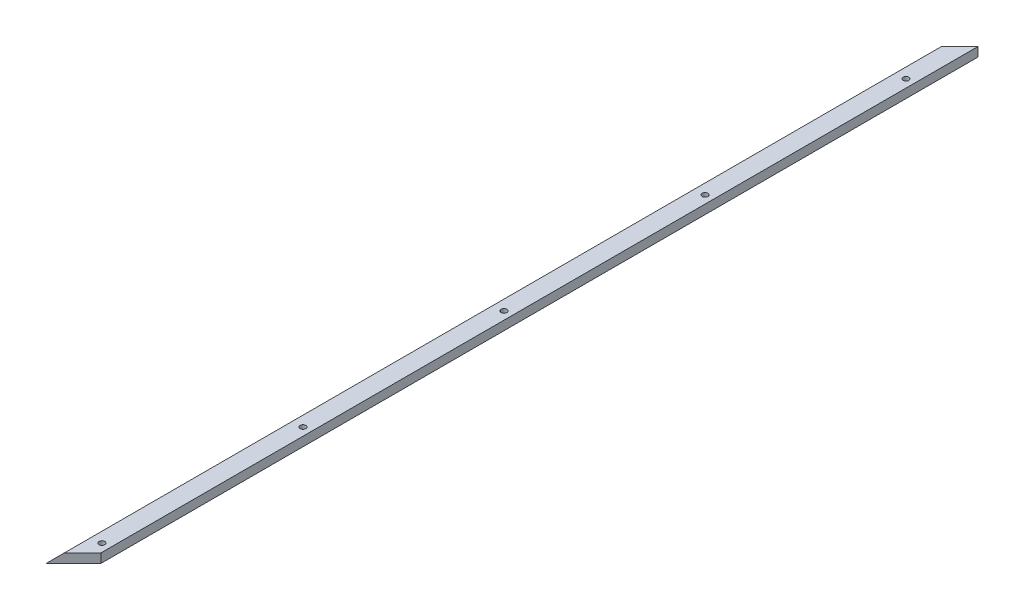
ISO-10303-21;
HEADER;
FILE_DESCRIPTION(('STEP AP214'),'2;1');
FILE_NAME('part.step','',(''),(''),'','','');
FILE_SCHEMA(('AUTOMOTIVE_DESIGN { 1 0 10303 214 1 1 1 1 }'));
ENDSEC;
DATA;
#1=APPLICATION_CONTEXT('core data for automotive mechanical design processes');
#2=APPLICATION_PROTOCOL_DEFINITION('international standard','automotive_design',2000,#1);
#3=PRODUCT_CONTEXT('',#1,'mechanical');
#4=PRODUCT('Part','Part','',(#3));
#5=PRODUCT_RELATED_PRODUCT_CATEGORY('part','',(#4));
#6=PRODUCT_DEFINITION_FORMATION('','',#4);
#7=PRODUCT_DEFINITION_CONTEXT('part definition',#1,'design');
#8=PRODUCT_DEFINITION('design','',#6,#7);
#9=PRODUCT_DEFINITION_SHAPE('','',#8);
#10=(LENGTH_UNIT() NAMED_UNIT(*) SI_UNIT(.MILLI.,.METRE.));
#11=(NAMED_UNIT(*) PLANE_ANGLE_UNIT() SI_UNIT($,.RADIAN.));
#12=(NAMED_UNIT(*) SI_UNIT($,.STERADIAN.) SOLID_ANGLE_UNIT());
#13=UNCERTAINTY_MEASURE_WITH_UNIT(LENGTH_MEASURE(1.E-05),#10,'distance_accuracy_value','');
#14=(GEOMETRIC_REPRESENTATION_CONTEXT(3) GLOBAL_UNCERTAINTY_ASSIGNED_CONTEXT((#13)) GLOBAL_UNIT_ASSIGNED_CONTEXT((#10,
#11,#12)) REPRESENTATION_CONTEXT('',''));
#15=CARTESIAN_POINT('',(0.,0.,0.));
#16=DIRECTION('',(0.,0.,1.));
#17=DIRECTION('',(1.,0.,0.));
#18=AXIS2_PLACEMENT_3D('',#15,#16,#17);
#19=CARTESIAN_POINT('',(-38.1,0.,1219.2));
#20=DIRECTION('',(0.,1.,0.));
#21=DIRECTION('',(0.,0.,1.));
#22=AXIS2_PLACEMENT_3D('',#19,#20,#21);
#23=PLANE('',#22);
#24=CARTESIAN_POINT('',(-11.1124999999941,0.,50.8000000000001));
#25=DIRECTION('',(0.,-1.,0.));
#26=DIRECTION('',(0.,0.,-1.));
#27=AXIS2_PLACEMENT_3D('',#24,#25,#26);
#28=CIRCLE('',#27,3.96875);
#29=CARTESIAN_POINT('',(-11.1124999999941,0.,46.8312500000001));
#30=VERTEX_POINT('',#29);
#31=EDGE_CURVE('E117',#30,#30,#28,.T.);
#32=ORIENTED_EDGE('',*,*,#31,.F.);
#33=EDGE_LOOP('',(#32));
#34=FACE_BOUND('',#33,.T.);
#35=CARTESIAN_POINT('',(-11.1124999999971,0.,330.2));
#36=DIRECTION('',(0.,-1.,0.));
#37=DIRECTION('',(0.,0.,-1.));
#38=AXIS2_PLACEMENT_3D('',#35,#36,#37);
#39=CIRCLE('',#38,3.96875);
#40=CARTESIAN_POINT('',(-11.1124999999971,0.,326.23125));
#41=VERTEX_POINT('',#40);
#42=EDGE_CURVE('E125',#41,#41,#39,.T.);
#43=ORIENTED_EDGE('',*,*,#42,.F.);
#44=EDGE_LOOP('',(#43));
#45=FACE_BOUND('',#44,.T.);
#46=CARTESIAN_POINT('',(-11.1125,0.,609.6));
#47=DIRECTION('',(0.,-1.,0.));
#48=DIRECTION('',(0.,0.,-1.));
#49=AXIS2_PLACEMENT_3D('',#46,#47,#48);
#50=CIRCLE('',#49,3.96875);
#51=CARTESIAN_POINT('',(-11.1125,0.,605.63125));
#52=VERTEX_POINT('',#51);
#53=EDGE_CURVE('E132',#52,#52,#50,.T.);
#54=ORIENTED_EDGE('',*,*,#53,.F.);
#55=EDGE_LOOP('',(#54));
#56=FACE_BOUND('',#55,.T.);
#57=CARTESIAN_POINT('',(-11.1125000000029,0.,889.));
#58=DIRECTION('',(0.,-1.,0.));
#59=DIRECTION('',(0.,0.,-1.));
#60=AXIS2_PLACEMENT_3D('',#57,#58,#59);
#61=CIRCLE('',#60,3.96875);
#62=CARTESIAN_POINT('',(-11.1125000000029,0.,885.03125));
#63=VERTEX_POINT('',#62);
#64=EDGE_CURVE('E138',#63,#63,#61,.T.);
#65=ORIENTED_EDGE('',*,*,#64,.F.);
#66=EDGE_LOOP('',(#65));
#67=FACE_BOUND('',#66,.T.);
#68=CARTESIAN_POINT('',(-11.1125000000059,0.,1168.4));
#69=DIRECTION('',(0.,-1.,0.));
#70=DIRECTION('',(0.,0.,-1.));
#71=AXIS2_PLACEMENT_3D('',#68,#69,#70);
#72=CIRCLE('',#71,3.96875);
#73=CARTESIAN_POINT('',(-11.1125000000059,0.,1164.43125));
#74=VERTEX_POINT('',#73);
#75=EDGE_CURVE('E144',#74,#74,#72,.T.);
#76=ORIENTED_EDGE('',*,*,#75,.F.);
#77=EDGE_LOOP('',(#76));
#78=FACE_BOUND('',#77,.T.);
#79=DIRECTION('',(0.,0.,-1.));
#80=VECTOR('',#79,1.);
#81=CARTESIAN_POINT('',(0.,0.,1219.2));
#82=LINE('',#81,#80);
#83=CARTESIAN_POINT('',(0.,0.,1181.1));
#84=VERTEX_POINT('',#83);
#85=CARTESIAN_POINT('',(0.,0.,-38.0999999999996));
#86=VERTEX_POINT('',#85);
#87=EDGE_CURVE('E11',#84,#86,#82,.T.);
#88=ORIENTED_EDGE('',*,*,#87,.F.);
#89=DIRECTION('',(-0.707106781186551,0.,0.707106781186544));
#90=VECTOR('',#89,1.);
#91=CARTESIAN_POINT('',(0.,0.,1181.1));
#92=LINE('',#91,#90);
#93=CARTESIAN_POINT('',(-38.1,0.,1219.2));
#94=VERTEX_POINT('',#93);
#95=EDGE_CURVE('E112',#84,#94,#92,.T.);
#96=ORIENTED_EDGE('',*,*,#95,.T.);
#97=DIRECTION('',(0.,0.,-1.));
#98=VECTOR('',#97,1.);
#99=CARTESIAN_POINT('',(-38.1,0.,1219.2));
#100=LINE('',#99,#98);
#101=CARTESIAN_POINT('',(-38.1,0.,0.));
#102=VERTEX_POINT('',#101);
#103=EDGE_CURVE('E93',#94,#102,#100,.T.);
#104=ORIENTED_EDGE('',*,*,#103,.T.);
#105=DIRECTION('',(0.707106781186551,0.,-0.707106781186544));
#106=VECTOR('',#105,1.);
#107=CARTESIAN_POINT('',(14.7142632281583,0.,-52.8142632281578));
#108=LINE('',#107,#106);
#109=EDGE_CURVE('E73',#102,#86,#108,.T.);
#110=ORIENTED_EDGE('',*,*,#109,.T.);
#111=EDGE_LOOP('',(#88,#96,#104,#110));
#112=FACE_BOUND('',#111,.T.);
#113=ADVANCED_FACE('F36',(#34,#45,#56,#67,#78,#112),#23,.F.);
#114=CARTESIAN_POINT('',(0.,0.,1219.2));
#115=DIRECTION('',(-1.,0.,0.));
#116=DIRECTION('',(0.,0.,1.));
#117=AXIS2_PLACEMENT_3D('',#114,#115,#116);
#118=PLANE('',#117);
#119=DIRECTION('',(0.,0.,-1.));
#120=VECTOR('',#119,1.);
#121=CARTESIAN_POINT('',(0.,12.7,1219.2));
#122=LINE('',#121,#120);
#123=CARTESIAN_POINT('',(0.,12.7,1181.1));
#124=VERTEX_POINT('',#123);
#125=CARTESIAN_POINT('',(0.,12.7,-38.0999999999996));
#126=VERTEX_POINT('',#125);
#127=EDGE_CURVE('E44',#124,#126,#122,.T.);
#128=ORIENTED_EDGE('',*,*,#127,.F.);
#129=DIRECTION('',(0.,1.,0.));
#130=VECTOR('',#129,1.);
#131=CARTESIAN_POINT('',(0.,0.,1181.1));
#132=LINE('',#131,#130);
#133=EDGE_CURVE('E63',#84,#124,#132,.T.);
#134=ORIENTED_EDGE('',*,*,#133,.F.);
#135=ORIENTED_EDGE('',*,*,#87,.T.);
#136=DIRECTION('',(0.,1.,0.));
#137=VECTOR('',#136,1.);
#138=CARTESIAN_POINT('',(0.,12.7,-38.0999999999996));
#139=LINE('',#138,#137);
#140=EDGE_CURVE('E109',#86,#126,#139,.T.);
#141=ORIENTED_EDGE('',*,*,#140,.T.);
#142=EDGE_LOOP('',(#128,#134,#135,#141));
#143=FACE_BOUND('',#142,.T.);
#144=ADVANCED_FACE('F156',(#143),#118,.F.);
#145=CARTESIAN_POINT('',(0.,12.7,1219.2));
#146=DIRECTION('',(0.,-1.,0.));
#147=DIRECTION('',(1.,0.,0.));
#148=AXIS2_PLACEMENT_3D('',#145,#146,#147);
#149=PLANE('',#148);
#150=CARTESIAN_POINT('',(-11.1124999999941,12.7,50.8000000000001));
#151=DIRECTION('',(0.,-1.,0.));
#152=DIRECTION('',(0.,0.,-1.));
#153=AXIS2_PLACEMENT_3D('',#150,#151,#152);
#154=CIRCLE('',#153,3.96875);
#155=CARTESIAN_POINT('',(-11.1124999999941,12.7,46.8312500000001));
#156=VERTEX_POINT('',#155);
#157=EDGE_CURVE('E121',#156,#156,#154,.T.);
#158=ORIENTED_EDGE('',*,*,#157,.T.);
#159=EDGE_LOOP('',(#158));
#160=FACE_BOUND('',#159,.T.);
#161=CARTESIAN_POINT('',(-11.1124999999971,12.7,330.2));
#162=DIRECTION('',(0.,-1.,0.));
#163=DIRECTION('',(0.,0.,-1.));
#164=AXIS2_PLACEMENT_3D('',#161,#162,#163);
#165=CIRCLE('',#164,3.96875);
#166=CARTESIAN_POINT('',(-11.1124999999971,12.7,326.23125));
#167=VERTEX_POINT('',#166);
#168=EDGE_CURVE('E128',#167,#167,#165,.T.);
#169=ORIENTED_EDGE('',*,*,#168,.T.);
#170=EDGE_LOOP('',(#169));
#171=FACE_BOUND('',#170,.T.);
#172=CARTESIAN_POINT('',(-11.1125,12.7,609.6));
#173=DIRECTION('',(0.,-1.,0.));
#174=DIRECTION('',(0.,0.,-1.));
#175=AXIS2_PLACEMENT_3D('',#172,#173,#174);
#176=CIRCLE('',#175,3.96875);
#177=CARTESIAN_POINT('',(-11.1125,12.7,605.63125));
#178=VERTEX_POINT('',#177);
#179=EDGE_CURVE('E135',#178,#178,#176,.T.);
#180=ORIENTED_EDGE('',*,*,#179,.T.);
#181=EDGE_LOOP('',(#180));
#182=FACE_BOUND('',#181,.T.);
#183=CARTESIAN_POINT('',(-11.1125000000029,12.7,889.));
#184=DIRECTION('',(0.,-1.,0.));
#185=DIRECTION('',(0.,0.,-1.));
#186=AXIS2_PLACEMENT_3D('',#183,#184,#185);
#187=CIRCLE('',#186,3.96875);
#188=CARTESIAN_POINT('',(-11.1125000000029,12.7,885.03125));
#189=VERTEX_POINT('',#188);
#190=EDGE_CURVE('E141',#189,#189,#187,.T.);
#191=ORIENTED_EDGE('',*,*,#190,.T.);
#192=EDGE_LOOP('',(#191));
#193=FACE_BOUND('',#192,.T.);
#194=CARTESIAN_POINT('',(-11.1125000000059,12.7,1168.4));
#195=DIRECTION('',(0.,-1.,0.));
#196=DIRECTION('',(0.,0.,-1.));
#197=AXIS2_PLACEMENT_3D('',#194,#195,#196);
#198=CIRCLE('',#197,3.96875);
#199=CARTESIAN_POINT('',(-11.1125000000059,12.7,1164.43125));
#200=VERTEX_POINT('',#199);
#201=EDGE_CURVE('E147',#200,#200,#198,.T.);
#202=ORIENTED_EDGE('',*,*,#201,.T.);
#203=EDGE_LOOP('',(#202));
#204=FACE_BOUND('',#203,.T.);
#205=DIRECTION('',(0.,0.,-1.));
#206=VECTOR('',#205,1.);
#207=CARTESIAN_POINT('',(-25.3999999999999,12.7,1219.2));
#208=LINE('',#207,#206);
#209=CARTESIAN_POINT('',(-25.3999999999999,12.7,1206.5));
#210=VERTEX_POINT('',#209);
#211=CARTESIAN_POINT('',(-25.3999999999999,12.7,-12.7));
#212=VERTEX_POINT('',#211);
#213=EDGE_CURVE('E85',#210,#212,#208,.T.);
#214=ORIENTED_EDGE('',*,*,#213,.F.);
#215=DIRECTION('',(-0.707106781186551,0.,0.707106781186544));
#216=VECTOR('',#215,1.);
#217=CARTESIAN_POINT('',(0.,12.7,1181.1));
#218=LINE('',#217,#216);
#219=EDGE_CURVE('E51',#124,#210,#218,.T.);
#220=ORIENTED_EDGE('',*,*,#219,.F.);
#221=ORIENTED_EDGE('',*,*,#127,.T.);
#222=DIRECTION('',(-0.707106781186551,0.,0.707106781186544));
#223=VECTOR('',#222,1.);
#224=CARTESIAN_POINT('',(2.01426322815824,12.7,-40.1142632281579));
#225=LINE('',#224,#223);
#226=EDGE_CURVE('E97',#126,#212,#225,.T.);
#227=ORIENTED_EDGE('',*,*,#226,.T.);
#228=EDGE_LOOP('',(#214,#220,#221,#227));
#229=FACE_BOUND('',#228,.T.);
#230=ADVANCED_FACE('F101',(#160,#171,#182,#193,#204,#229),#149,.F.);
#231=CARTESIAN_POINT('',(-25.3999999999999,12.7,1219.2));
#232=DIRECTION('',(0.707106781186544,-0.707106781186551,0.));
#233=DIRECTION('',(0.707106781186551,0.707106781186544,0.));
#234=AXIS2_PLACEMENT_3D('',#231,#232,#233);
#235=PLANE('',#234);
#236=ORIENTED_EDGE('',*,*,#103,.F.);
#237=DIRECTION('',(0.57735026918963,0.577350269189624,-0.577350269189624));
#238=VECTOR('',#237,1.);
#239=CARTESIAN_POINT('',(-29.6333333333332,8.4666666666667,1210.73333333333));
#240=LINE('',#239,#238);
#241=EDGE_CURVE('E56',#94,#210,#240,.T.);
#242=ORIENTED_EDGE('',*,*,#241,.T.);
#243=ORIENTED_EDGE('',*,*,#213,.T.);
#244=DIRECTION('',(-0.57735026918963,-0.577350269189623,0.577350269189624));
#245=VECTOR('',#244,1.);
#246=CARTESIAN_POINT('',(-15.5904911812278,22.5095088187719,-22.5095088187719));
#247=LINE('',#246,#245);
#248=EDGE_CURVE('E88',#212,#102,#247,.T.);
#249=ORIENTED_EDGE('',*,*,#248,.T.);
#250=EDGE_LOOP('',(#236,#242,#243,#249));
#251=FACE_BOUND('',#250,.T.);
#252=ADVANCED_FACE('F87',(#251),#235,.F.);
#253=CARTESIAN_POINT('',(-11.1125000000059,0.,1168.4));
#254=DIRECTION('',(0.,-1.,0.));
#255=DIRECTION('',(0.,0.,-1.));
#256=AXIS2_PLACEMENT_3D('',#253,#254,#255);
#257=CYLINDRICAL_SURFACE('',#256,3.96875);
#258=ORIENTED_EDGE('',*,*,#201,.F.);
#259=EDGE_LOOP('',(#258));
#260=FACE_BOUND('',#259,.T.);
#261=ORIENTED_EDGE('',*,*,#75,.T.);
#262=EDGE_LOOP('',(#261));
#263=FACE_BOUND('',#262,.T.);
#264=ADVANCED_FACE('F168',(#260,#263),#257,.F.);
#265=CARTESIAN_POINT('',(-11.1125000000029,0.,889.));
#266=DIRECTION('',(0.,-1.,0.));
#267=DIRECTION('',(0.,0.,-1.));
#268=AXIS2_PLACEMENT_3D('',#265,#266,#267);
#269=CYLINDRICAL_SURFACE('',#268,3.96875);
#270=ORIENTED_EDGE('',*,*,#190,.F.);
#271=EDGE_LOOP('',(#270));
#272=FACE_BOUND('',#271,.T.);
#273=ORIENTED_EDGE('',*,*,#64,.T.);
#274=EDGE_LOOP('',(#273));
#275=FACE_BOUND('',#274,.T.);
#276=ADVANCED_FACE('F171',(#272,#275),#269,.F.);
#277=CARTESIAN_POINT('',(-11.1125,0.,609.6));
#278=DIRECTION('',(0.,-1.,0.));
#279=DIRECTION('',(0.,0.,-1.));
#280=AXIS2_PLACEMENT_3D('',#277,#278,#279);
#281=CYLINDRICAL_SURFACE('',#280,3.96875);
#282=ORIENTED_EDGE('',*,*,#179,.F.);
#283=EDGE_LOOP('',(#282));
#284=FACE_BOUND('',#283,.T.);
#285=ORIENTED_EDGE('',*,*,#53,.T.);
#286=EDGE_LOOP('',(#285));
#287=FACE_BOUND('',#286,.T.);
#288=ADVANCED_FACE('F175',(#284,#287),#281,.F.);
#289=CARTESIAN_POINT('',(-11.1124999999971,0.,330.2));
#290=DIRECTION('',(0.,-1.,0.));
#291=DIRECTION('',(0.,0.,-1.));
#292=AXIS2_PLACEMENT_3D('',#289,#290,#291);
#293=CYLINDRICAL_SURFACE('',#292,3.96875);
#294=ORIENTED_EDGE('',*,*,#168,.F.);
#295=EDGE_LOOP('',(#294));
#296=FACE_BOUND('',#295,.T.);
#297=ORIENTED_EDGE('',*,*,#42,.T.);
#298=EDGE_LOOP('',(#297));
#299=FACE_BOUND('',#298,.T.);
#300=ADVANCED_FACE('F179',(#296,#299),#293,.F.);
#301=CARTESIAN_POINT('',(-11.1124999999941,0.,50.8000000000001));
#302=DIRECTION('',(0.,-1.,0.));
#303=DIRECTION('',(0.,0.,-1.));
#304=AXIS2_PLACEMENT_3D('',#301,#302,#303);
#305=CYLINDRICAL_SURFACE('',#304,3.96875);
#306=ORIENTED_EDGE('',*,*,#157,.F.);
#307=EDGE_LOOP('',(#306));
#308=FACE_BOUND('',#307,.T.);
#309=ORIENTED_EDGE('',*,*,#31,.T.);
#310=EDGE_LOOP('',(#309));
#311=FACE_BOUND('',#310,.T.);
#312=ADVANCED_FACE('F183',(#308,#311),#305,.F.);
#313=CARTESIAN_POINT('',(0.,0.,1181.1));
#314=DIRECTION('',(-0.707106781186544,0.,-0.707106781186551));
#315=DIRECTION('',(-0.707106781186551,0.,0.707106781186544));
#316=AXIS2_PLACEMENT_3D('',#313,#314,#315);
#317=PLANE('',#316);
#318=ORIENTED_EDGE('',*,*,#95,.F.);
#319=ORIENTED_EDGE('',*,*,#133,.T.);
#320=ORIENTED_EDGE('',*,*,#219,.T.);
#321=ORIENTED_EDGE('',*,*,#241,.F.);
#322=EDGE_LOOP('',(#318,#319,#320,#321));
#323=FACE_BOUND('',#322,.T.);
#324=ADVANCED_FACE('F154',(#323),#317,.F.);
#325=CARTESIAN_POINT('',(-19.0499999999998,0.,-19.05));
#326=DIRECTION('',(0.707106781186544,0.,0.707106781186551));
#327=DIRECTION('',(0.707106781186551,0.,-0.707106781186544));
#328=AXIS2_PLACEMENT_3D('',#325,#326,#327);
#329=PLANE('',#328);
#330=ORIENTED_EDGE('',*,*,#109,.F.);
#331=ORIENTED_EDGE('',*,*,#248,.F.);
#332=ORIENTED_EDGE('',*,*,#226,.F.);
#333=ORIENTED_EDGE('',*,*,#140,.F.);
#334=EDGE_LOOP('',(#330,#331,#332,#333));
#335=FACE_BOUND('',#334,.T.);
#336=ADVANCED_FACE('F96',(#335),#329,.F.);
#337=CLOSED_SHELL('',(#113,#144,#230,#252,#264,#276,#288,#300,#312,#324,#336));
#338=MANIFOLD_SOLID_BREP('B2',#337);
#339=ADVANCED_BREP_SHAPE_REPRESENTATION('',(#18,#338),#14);
#340=SHAPE_DEFINITION_REPRESENTATION(#9,#339);
ENDSEC;
END-ISO-10303-21;
